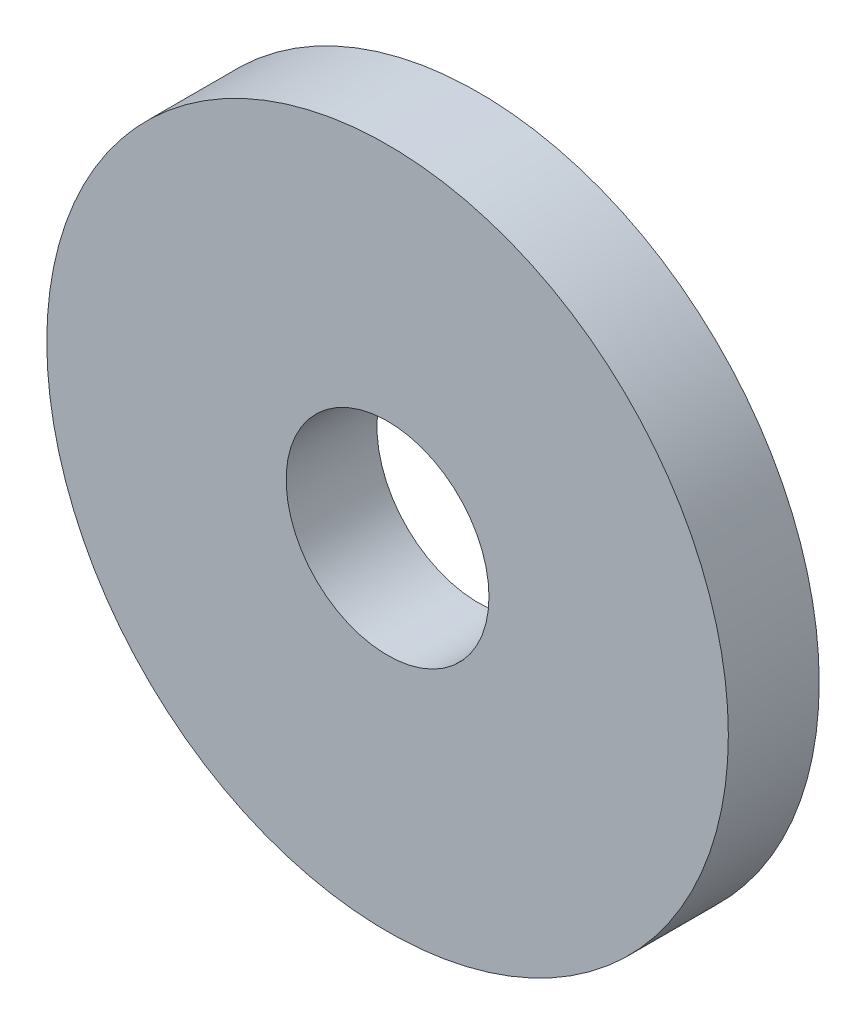
ISO-10303-21;
HEADER;
FILE_DESCRIPTION(('STEP AP214'),'2;1');
FILE_NAME('part.step','',(''),(''),'','','');
FILE_SCHEMA(('AUTOMOTIVE_DESIGN { 1 0 10303 214 1 1 1 1 }'));
ENDSEC;
DATA;
#1=APPLICATION_CONTEXT('core data for automotive mechanical design processes');
#2=APPLICATION_PROTOCOL_DEFINITION('international standard','automotive_design',2000,#1);
#3=PRODUCT_CONTEXT('',#1,'mechanical');
#4=PRODUCT('Part','Part','',(#3));
#5=PRODUCT_RELATED_PRODUCT_CATEGORY('part','',(#4));
#6=PRODUCT_DEFINITION_FORMATION('','',#4);
#7=PRODUCT_DEFINITION_CONTEXT('part definition',#1,'design');
#8=PRODUCT_DEFINITION('design','',#6,#7);
#9=PRODUCT_DEFINITION_SHAPE('','',#8);
#10=(LENGTH_UNIT() NAMED_UNIT(*) SI_UNIT(.MILLI.,.METRE.));
#11=(NAMED_UNIT(*) PLANE_ANGLE_UNIT() SI_UNIT($,.RADIAN.));
#12=(NAMED_UNIT(*) SI_UNIT($,.STERADIAN.) SOLID_ANGLE_UNIT());
#13=UNCERTAINTY_MEASURE_WITH_UNIT(LENGTH_MEASURE(1.E-05),#10,'distance_accuracy_value','');
#14=(GEOMETRIC_REPRESENTATION_CONTEXT(3) GLOBAL_UNCERTAINTY_ASSIGNED_CONTEXT((#13)) GLOBAL_UNIT_ASSIGNED_CONTEXT((#10,
#11,#12)) REPRESENTATION_CONTEXT('',''));
#15=CARTESIAN_POINT('',(0.,0.,0.));
#16=DIRECTION('',(0.,0.,1.));
#17=DIRECTION('',(1.,0.,0.));
#18=AXIS2_PLACEMENT_3D('',#15,#16,#17);
#19=CARTESIAN_POINT('',(0.,0.,2.1336));
#20=DIRECTION('',(0.,0.,1.));
#21=DIRECTION('',(1.,0.,0.));
#22=AXIS2_PLACEMENT_3D('',#19,#20,#21);
#23=PLANE('',#22);
#24=CARTESIAN_POINT('',(0.,0.,2.1336));
#25=DIRECTION('',(0.,0.,1.));
#26=DIRECTION('',(1.,0.,0.));
#27=AXIS2_PLACEMENT_3D('',#24,#25,#26);
#28=CIRCLE('',#27,16.002);
#29=CARTESIAN_POINT('',(16.002,0.,2.1336));
#30=VERTEX_POINT('',#29);
#31=EDGE_CURVE('E10',#30,#30,#28,.T.);
#32=ORIENTED_EDGE('',*,*,#31,.T.);
#33=EDGE_LOOP('',(#32));
#34=FACE_BOUND('',#33,.T.);
#35=CARTESIAN_POINT('',(0.,0.,2.1336));
#36=DIRECTION('',(0.,0.,1.));
#37=DIRECTION('',(1.,0.,0.));
#38=AXIS2_PLACEMENT_3D('',#35,#36,#37);
#39=CIRCLE('',#38,4.7625);
#40=CARTESIAN_POINT('',(4.7625,0.,2.1336));
#41=VERTEX_POINT('',#40);
#42=EDGE_CURVE('E56',#41,#41,#39,.T.);
#43=ORIENTED_EDGE('',*,*,#42,.F.);
#44=EDGE_LOOP('',(#43));
#45=FACE_BOUND('',#44,.T.);
#46=ADVANCED_FACE('F43',(#34,#45),#23,.T.);
#47=CARTESIAN_POINT('',(0.,0.,-2.1336));
#48=DIRECTION('',(0.,0.,1.));
#49=DIRECTION('',(1.,0.,0.));
#50=AXIS2_PLACEMENT_3D('',#47,#48,#49);
#51=PLANE('',#50);
#52=CARTESIAN_POINT('',(0.,0.,-2.1336));
#53=DIRECTION('',(0.,0.,1.));
#54=DIRECTION('',(1.,0.,0.));
#55=AXIS2_PLACEMENT_3D('',#52,#53,#54);
#56=CIRCLE('',#55,16.002);
#57=CARTESIAN_POINT('',(16.002,0.,-2.1336));
#58=VERTEX_POINT('',#57);
#59=EDGE_CURVE('E47',#58,#58,#56,.T.);
#60=ORIENTED_EDGE('',*,*,#59,.F.);
#61=EDGE_LOOP('',(#60));
#62=FACE_BOUND('',#61,.T.);
#63=CARTESIAN_POINT('',(0.,0.,-2.1336));
#64=DIRECTION('',(0.,0.,1.));
#65=DIRECTION('',(1.,0.,0.));
#66=AXIS2_PLACEMENT_3D('',#63,#64,#65);
#67=CIRCLE('',#66,4.7625);
#68=CARTESIAN_POINT('',(4.7625,0.,-2.1336));
#69=VERTEX_POINT('',#68);
#70=EDGE_CURVE('E58',#69,#69,#67,.T.);
#71=ORIENTED_EDGE('',*,*,#70,.T.);
#72=EDGE_LOOP('',(#71));
#73=FACE_BOUND('',#72,.T.);
#74=ADVANCED_FACE('F70',(#62,#73),#51,.F.);
#75=CARTESIAN_POINT('',(0.,0.,2.1336));
#76=DIRECTION('',(0.,0.,-1.));
#77=DIRECTION('',(-1.,0.,0.));
#78=AXIS2_PLACEMENT_3D('',#75,#76,#77);
#79=CYLINDRICAL_SURFACE('',#78,16.002);
#80=ORIENTED_EDGE('',*,*,#31,.F.);
#81=EDGE_LOOP('',(#80));
#82=FACE_BOUND('',#81,.T.);
#83=ORIENTED_EDGE('',*,*,#59,.T.);
#84=EDGE_LOOP('',(#83));
#85=FACE_BOUND('',#84,.T.);
#86=ADVANCED_FACE('F45',(#82,#85),#79,.T.);
#87=CARTESIAN_POINT('',(0.,0.,2.1336));
#88=DIRECTION('',(0.,0.,-1.));
#89=DIRECTION('',(-1.,0.,0.));
#90=AXIS2_PLACEMENT_3D('',#87,#88,#89);
#91=CYLINDRICAL_SURFACE('',#90,4.7625);
#92=ORIENTED_EDGE('',*,*,#42,.T.);
#93=EDGE_LOOP('',(#92));
#94=FACE_BOUND('',#93,.T.);
#95=ORIENTED_EDGE('',*,*,#70,.F.);
#96=EDGE_LOOP('',(#95));
#97=FACE_BOUND('',#96,.T.);
#98=ADVANCED_FACE('F66',(#94,#97),#91,.F.);
#99=CLOSED_SHELL('',(#46,#74,#86,#98));
#100=MANIFOLD_SOLID_BREP('B2',#99);
#101=ADVANCED_BREP_SHAPE_REPRESENTATION('',(#18,#100),#14);
#102=SHAPE_DEFINITION_REPRESENTATION(#9,#101);
ENDSEC;
END-ISO-10303-21;
